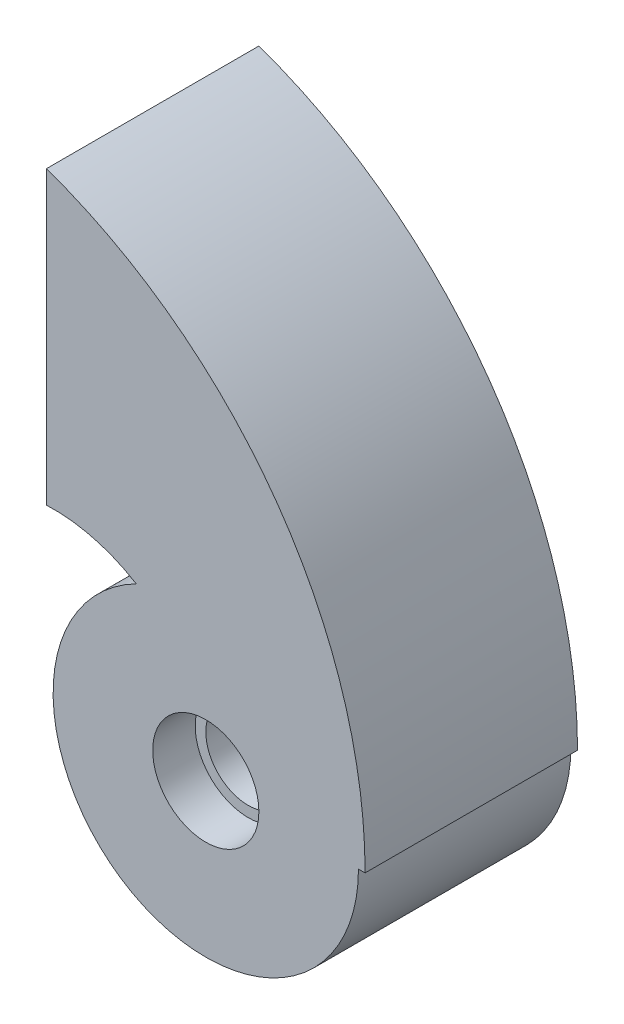
ISO-10303-21;
HEADER;
FILE_DESCRIPTION(('STEP AP214'),'2;1');
FILE_NAME('part.step','',(''),(''),'','','');
FILE_SCHEMA(('AUTOMOTIVE_DESIGN { 1 0 10303 214 1 1 1 1 }'));
ENDSEC;
DATA;
#1=APPLICATION_CONTEXT('core data for automotive mechanical design processes');
#2=APPLICATION_PROTOCOL_DEFINITION('international standard','automotive_design',2000,#1);
#3=PRODUCT_CONTEXT('',#1,'mechanical');
#4=PRODUCT('Part','Part','',(#3));
#5=PRODUCT_RELATED_PRODUCT_CATEGORY('part','',(#4));
#6=PRODUCT_DEFINITION_FORMATION('','',#4);
#7=PRODUCT_DEFINITION_CONTEXT('part definition',#1,'design');
#8=PRODUCT_DEFINITION('design','',#6,#7);
#9=PRODUCT_DEFINITION_SHAPE('','',#8);
#10=(LENGTH_UNIT() NAMED_UNIT(*) SI_UNIT(.MILLI.,.METRE.));
#11=(NAMED_UNIT(*) PLANE_ANGLE_UNIT() SI_UNIT($,.RADIAN.));
#12=(NAMED_UNIT(*) SI_UNIT($,.STERADIAN.) SOLID_ANGLE_UNIT());
#13=UNCERTAINTY_MEASURE_WITH_UNIT(LENGTH_MEASURE(1.E-05),#10,'distance_accuracy_value','');
#14=(GEOMETRIC_REPRESENTATION_CONTEXT(3) GLOBAL_UNCERTAINTY_ASSIGNED_CONTEXT((#13)) GLOBAL_UNIT_ASSIGNED_CONTEXT((#10,
#11,#12)) REPRESENTATION_CONTEXT('',''));
#15=CARTESIAN_POINT('',(0.,0.,0.));
#16=DIRECTION('',(0.,0.,1.));
#17=DIRECTION('',(1.,0.,0.));
#18=AXIS2_PLACEMENT_3D('',#15,#16,#17);
#19=CARTESIAN_POINT('',(0.,0.,-10.));
#20=DIRECTION('',(0.,0.,1.));
#21=DIRECTION('',(1.,0.,0.));
#22=AXIS2_PLACEMENT_3D('',#19,#20,#21);
#23=CYLINDRICAL_SURFACE('',#22,4.);
#24=CARTESIAN_POINT('',(0.,0.,-6.));
#25=DIRECTION('',(0.,0.,-1.));
#26=DIRECTION('',(-1.,0.,0.));
#27=AXIS2_PLACEMENT_3D('',#24,#25,#26);
#28=CIRCLE('',#27,4.);
#29=CARTESIAN_POINT('',(-4.,0.,-6.));
#30=VERTEX_POINT('',#29);
#31=EDGE_CURVE('E109',#30,#30,#28,.F.);
#32=ORIENTED_EDGE('',*,*,#31,.F.);
#33=EDGE_LOOP('',(#32));
#34=FACE_BOUND('',#33,.T.);
#35=CARTESIAN_POINT('',(0.,0.,6.));
#36=DIRECTION('',(0.,0.,1.));
#37=DIRECTION('',(1.,0.,0.));
#38=AXIS2_PLACEMENT_3D('',#35,#36,#37);
#39=CIRCLE('',#38,4.);
#40=CARTESIAN_POINT('',(4.,0.,6.));
#41=VERTEX_POINT('',#40);
#42=EDGE_CURVE('E43',#41,#41,#39,.F.);
#43=ORIENTED_EDGE('',*,*,#42,.F.);
#44=EDGE_LOOP('',(#43));
#45=FACE_BOUND('',#44,.T.);
#46=ADVANCED_FACE('F39',(#34,#45),#23,.F.);
#47=CARTESIAN_POINT('',(0.,0.,-10.));
#48=DIRECTION('',(0.,0.,1.));
#49=DIRECTION('',(1.,0.,0.));
#50=AXIS2_PLACEMENT_3D('',#47,#48,#49);
#51=CYLINDRICAL_SURFACE('',#50,14.375);
#52=DIRECTION('',(0.,0.,1.));
#53=VECTOR('',#52,1.);
#54=CARTESIAN_POINT('',(14.375,0.,-10.));
#55=LINE('',#54,#53);
#56=CARTESIAN_POINT('',(14.375,0.,10.));
#57=VERTEX_POINT('',#56);
#58=CARTESIAN_POINT('',(14.375,0.,-10.));
#59=VERTEX_POINT('',#58);
#60=EDGE_CURVE('E126',#57,#59,#55,.F.);
#61=ORIENTED_EDGE('',*,*,#60,.F.);
#62=CARTESIAN_POINT('',(0.,0.,10.));
#63=DIRECTION('',(0.,0.,1.));
#64=DIRECTION('',(1.,0.,0.));
#65=AXIS2_PLACEMENT_3D('',#62,#63,#64);
#66=CIRCLE('',#65,14.375);
#67=CARTESIAN_POINT('',(-6.54891304347826,12.7965762197926,10.));
#68=VERTEX_POINT('',#67);
#69=EDGE_CURVE('E48',#68,#57,#66,.T.);
#70=ORIENTED_EDGE('',*,*,#69,.F.);
#71=DIRECTION('',(0.,0.,1.));
#72=VECTOR('',#71,1.);
#73=CARTESIAN_POINT('',(-6.54891304347826,12.7965762197926,0.));
#74=LINE('',#73,#72);
#75=CARTESIAN_POINT('',(-6.54891304347826,12.7965762197926,-10.));
#76=VERTEX_POINT('',#75);
#77=EDGE_CURVE('E124',#76,#68,#74,.T.);
#78=ORIENTED_EDGE('',*,*,#77,.F.);
#79=CARTESIAN_POINT('',(0.,0.,-10.));
#80=DIRECTION('',(0.,0.,1.));
#81=DIRECTION('',(1.,0.,0.));
#82=AXIS2_PLACEMENT_3D('',#79,#80,#81);
#83=CIRCLE('',#82,14.375);
#84=EDGE_CURVE('E11',#76,#59,#83,.T.);
#85=ORIENTED_EDGE('',*,*,#84,.T.);
#86=EDGE_LOOP('',(#61,#70,#78,#85));
#87=FACE_BOUND('',#86,.T.);
#88=ADVANCED_FACE('F41',(#87),#51,.T.);
#89=CARTESIAN_POINT('',(0.,0.,-10.));
#90=DIRECTION('',(0.,0.,1.));
#91=DIRECTION('',(1.,0.,0.));
#92=AXIS2_PLACEMENT_3D('',#89,#90,#91);
#93=PLANE('',#92);
#94=CARTESIAN_POINT('',(0.,0.,-10.));
#95=DIRECTION('',(0.,0.,-1.));
#96=DIRECTION('',(-1.,0.,0.));
#97=AXIS2_PLACEMENT_3D('',#94,#95,#96);
#98=CIRCLE('',#97,5.);
#99=CARTESIAN_POINT('',(-5.,0.,-10.));
#100=VERTEX_POINT('',#99);
#101=EDGE_CURVE('E136',#100,#100,#98,.T.);
#102=ORIENTED_EDGE('',*,*,#101,.F.);
#103=EDGE_LOOP('',(#102));
#104=FACE_BOUND('',#103,.T.);
#105=ORIENTED_EDGE('',*,*,#84,.F.);
#106=CARTESIAN_POINT('',(-14.375,0.,-10.));
#107=DIRECTION('',(0.,0.,1.));
#108=DIRECTION('',(1.,0.,0.));
#109=AXIS2_PLACEMENT_3D('',#106,#107,#108);
#110=CIRCLE('',#109,15.);
#111=CARTESIAN_POINT('',(-15.,14.9869735103522,-10.));
#112=VERTEX_POINT('',#111);
#113=EDGE_CURVE('E120',#76,#112,#110,.T.);
#114=ORIENTED_EDGE('',*,*,#113,.T.);
#115=DIRECTION('',(0.,1.,0.));
#116=VECTOR('',#115,1.);
#117=CARTESIAN_POINT('',(-15.,42.4264068711928,-10.));
#118=LINE('',#117,#116);
#119=CARTESIAN_POINT('',(-15.,42.4264068711928,-10.));
#120=VERTEX_POINT('',#119);
#121=EDGE_CURVE('E122',#112,#120,#118,.T.);
#122=ORIENTED_EDGE('',*,*,#121,.T.);
#123=CARTESIAN_POINT('',(-30.,0.,-10.));
#124=DIRECTION('',(0.,0.,1.));
#125=DIRECTION('',(1.,0.,0.));
#126=AXIS2_PLACEMENT_3D('',#123,#124,#125);
#127=CIRCLE('',#126,45.);
#128=CARTESIAN_POINT('',(15.,0.,-10.));
#129=VERTEX_POINT('',#128);
#130=EDGE_CURVE('E91',#120,#129,#127,.F.);
#131=ORIENTED_EDGE('',*,*,#130,.T.);
#132=DIRECTION('',(-1.,0.,0.));
#133=VECTOR('',#132,1.);
#134=CARTESIAN_POINT('',(0.624999999999999,0.,-10.));
#135=LINE('',#134,#133);
#136=EDGE_CURVE('E132',#129,#59,#135,.T.);
#137=ORIENTED_EDGE('',*,*,#136,.T.);
#138=EDGE_LOOP('',(#105,#114,#122,#131,#137));
#139=FACE_BOUND('',#138,.T.);
#140=ADVANCED_FACE('F159',(#104,#139),#93,.F.);
#141=CARTESIAN_POINT('',(0.,0.,10.));
#142=DIRECTION('',(0.,0.,1.));
#143=DIRECTION('',(1.,0.,0.));
#144=AXIS2_PLACEMENT_3D('',#141,#142,#143);
#145=PLANE('',#144);
#146=CARTESIAN_POINT('',(0.,0.,10.));
#147=DIRECTION('',(0.,0.,1.));
#148=DIRECTION('',(1.,0.,0.));
#149=AXIS2_PLACEMENT_3D('',#146,#147,#148);
#150=CIRCLE('',#149,5.);
#151=CARTESIAN_POINT('',(5.,0.,10.));
#152=VERTEX_POINT('',#151);
#153=EDGE_CURVE('E141',#152,#152,#150,.T.);
#154=ORIENTED_EDGE('',*,*,#153,.F.);
#155=EDGE_LOOP('',(#154));
#156=FACE_BOUND('',#155,.T.);
#157=ORIENTED_EDGE('',*,*,#69,.T.);
#158=DIRECTION('',(1.,0.,0.));
#159=VECTOR('',#158,1.);
#160=CARTESIAN_POINT('',(0.624999999999999,0.,10.));
#161=LINE('',#160,#159);
#162=CARTESIAN_POINT('',(15.,0.,10.));
#163=VERTEX_POINT('',#162);
#164=EDGE_CURVE('E95',#57,#163,#161,.T.);
#165=ORIENTED_EDGE('',*,*,#164,.T.);
#166=CARTESIAN_POINT('',(-30.,0.,10.));
#167=DIRECTION('',(0.,0.,1.));
#168=DIRECTION('',(1.,0.,0.));
#169=AXIS2_PLACEMENT_3D('',#166,#167,#168);
#170=CIRCLE('',#169,45.);
#171=CARTESIAN_POINT('',(-15.,42.4264068711928,10.));
#172=VERTEX_POINT('',#171);
#173=EDGE_CURVE('E90',#163,#172,#170,.T.);
#174=ORIENTED_EDGE('',*,*,#173,.T.);
#175=DIRECTION('',(0.,-1.,0.));
#176=VECTOR('',#175,1.);
#177=CARTESIAN_POINT('',(-15.,42.4264068711928,10.));
#178=LINE('',#177,#176);
#179=CARTESIAN_POINT('',(-15.,14.9869735103522,10.));
#180=VERTEX_POINT('',#179);
#181=EDGE_CURVE('E98',#172,#180,#178,.T.);
#182=ORIENTED_EDGE('',*,*,#181,.T.);
#183=CARTESIAN_POINT('',(-14.375,0.,10.));
#184=DIRECTION('',(0.,0.,-1.));
#185=DIRECTION('',(-1.,0.,0.));
#186=AXIS2_PLACEMENT_3D('',#183,#184,#185);
#187=CIRCLE('',#186,15.);
#188=EDGE_CURVE('E104',#180,#68,#187,.T.);
#189=ORIENTED_EDGE('',*,*,#188,.T.);
#190=EDGE_LOOP('',(#157,#165,#174,#182,#189));
#191=FACE_BOUND('',#190,.T.);
#192=ADVANCED_FACE('F106',(#156,#191),#145,.T.);
#193=CARTESIAN_POINT('',(-30.,0.,-61.9615242270663));
#194=DIRECTION('',(0.,0.,1.));
#195=DIRECTION('',(1.,0.,0.));
#196=AXIS2_PLACEMENT_3D('',#193,#194,#195);
#197=CYLINDRICAL_SURFACE('',#196,45.);
#198=ORIENTED_EDGE('',*,*,#130,.F.);
#199=DIRECTION('',(0.,0.,1.));
#200=VECTOR('',#199,1.);
#201=CARTESIAN_POINT('',(-15.,42.4264068711928,-61.9615242270663));
#202=LINE('',#201,#200);
#203=EDGE_CURVE('E85',#120,#172,#202,.T.);
#204=ORIENTED_EDGE('',*,*,#203,.T.);
#205=ORIENTED_EDGE('',*,*,#173,.F.);
#206=DIRECTION('',(0.,0.,1.));
#207=VECTOR('',#206,1.);
#208=CARTESIAN_POINT('',(15.,0.,-61.9615242270663));
#209=LINE('',#208,#207);
#210=EDGE_CURVE('E118',#129,#163,#209,.T.);
#211=ORIENTED_EDGE('',*,*,#210,.F.);
#212=EDGE_LOOP('',(#198,#204,#205,#211));
#213=FACE_BOUND('',#212,.T.);
#214=ADVANCED_FACE('F87',(#213),#197,.T.);
#215=CARTESIAN_POINT('',(0.624999999999999,0.,-61.9615242270663));
#216=DIRECTION('',(0.,-1.,0.));
#217=DIRECTION('',(0.,0.,-1.));
#218=AXIS2_PLACEMENT_3D('',#215,#216,#217);
#219=PLANE('',#218);
#220=ORIENTED_EDGE('',*,*,#164,.F.);
#221=ORIENTED_EDGE('',*,*,#60,.T.);
#222=ORIENTED_EDGE('',*,*,#136,.F.);
#223=ORIENTED_EDGE('',*,*,#210,.T.);
#224=EDGE_LOOP('',(#220,#221,#222,#223));
#225=FACE_BOUND('',#224,.T.);
#226=ADVANCED_FACE('F129',(#225),#219,.T.);
#227=CARTESIAN_POINT('',(-14.375,0.,-61.9615242270663));
#228=DIRECTION('',(0.,0.,1.));
#229=DIRECTION('',(1.,0.,0.));
#230=AXIS2_PLACEMENT_3D('',#227,#228,#229);
#231=CYLINDRICAL_SURFACE('',#230,15.);
#232=ORIENTED_EDGE('',*,*,#113,.F.);
#233=ORIENTED_EDGE('',*,*,#77,.T.);
#234=ORIENTED_EDGE('',*,*,#188,.F.);
#235=DIRECTION('',(0.,0.,1.));
#236=VECTOR('',#235,1.);
#237=CARTESIAN_POINT('',(-15.,14.9869735103522,-61.9615242270663));
#238=LINE('',#237,#236);
#239=EDGE_CURVE('E94',#112,#180,#238,.T.);
#240=ORIENTED_EDGE('',*,*,#239,.F.);
#241=EDGE_LOOP('',(#232,#233,#234,#240));
#242=FACE_BOUND('',#241,.T.);
#243=ADVANCED_FACE('F167',(#242),#231,.F.);
#244=CARTESIAN_POINT('',(-15.,42.4264068711928,-61.9615242270663));
#245=DIRECTION('',(-1.,0.,0.));
#246=DIRECTION('',(0.,0.,1.));
#247=AXIS2_PLACEMENT_3D('',#244,#245,#246);
#248=PLANE('',#247);
#249=ORIENTED_EDGE('',*,*,#121,.F.);
#250=ORIENTED_EDGE('',*,*,#239,.T.);
#251=ORIENTED_EDGE('',*,*,#181,.F.);
#252=ORIENTED_EDGE('',*,*,#203,.F.);
#253=EDGE_LOOP('',(#249,#250,#251,#252));
#254=FACE_BOUND('',#253,.T.);
#255=ADVANCED_FACE('F99',(#254),#248,.T.);
#256=CARTESIAN_POINT('',(0.,0.,-6.));
#257=DIRECTION('',(0.,0.,-1.));
#258=DIRECTION('',(-1.,0.,0.));
#259=AXIS2_PLACEMENT_3D('',#256,#257,#258);
#260=PLANE('',#259);
#261=CARTESIAN_POINT('',(0.,0.,-6.));
#262=DIRECTION('',(0.,0.,-1.));
#263=DIRECTION('',(-1.,0.,0.));
#264=AXIS2_PLACEMENT_3D('',#261,#262,#263);
#265=CIRCLE('',#264,5.);
#266=CARTESIAN_POINT('',(-5.,0.,-6.));
#267=VERTEX_POINT('',#266);
#268=EDGE_CURVE('E112',#267,#267,#265,.T.);
#269=ORIENTED_EDGE('',*,*,#268,.T.);
#270=EDGE_LOOP('',(#269));
#271=FACE_BOUND('',#270,.T.);
#272=ORIENTED_EDGE('',*,*,#31,.T.);
#273=EDGE_LOOP('',(#272));
#274=FACE_BOUND('',#273,.T.);
#275=ADVANCED_FACE('F173',(#271,#274),#260,.T.);
#276=CARTESIAN_POINT('',(0.,0.,-6.));
#277=DIRECTION('',(0.,0.,-1.));
#278=DIRECTION('',(-1.,0.,0.));
#279=AXIS2_PLACEMENT_3D('',#276,#277,#278);
#280=CYLINDRICAL_SURFACE('',#279,5.);
#281=ORIENTED_EDGE('',*,*,#268,.F.);
#282=EDGE_LOOP('',(#281));
#283=FACE_BOUND('',#282,.T.);
#284=ORIENTED_EDGE('',*,*,#101,.T.);
#285=EDGE_LOOP('',(#284));
#286=FACE_BOUND('',#285,.T.);
#287=ADVANCED_FACE('F163',(#283,#286),#280,.F.);
#288=CARTESIAN_POINT('',(0.,0.,6.));
#289=DIRECTION('',(0.,0.,1.));
#290=DIRECTION('',(1.,0.,0.));
#291=AXIS2_PLACEMENT_3D('',#288,#289,#290);
#292=PLANE('',#291);
#293=CARTESIAN_POINT('',(0.,0.,6.));
#294=DIRECTION('',(0.,0.,1.));
#295=DIRECTION('',(1.,0.,0.));
#296=AXIS2_PLACEMENT_3D('',#293,#294,#295);
#297=CIRCLE('',#296,5.);
#298=CARTESIAN_POINT('',(5.,0.,6.));
#299=VERTEX_POINT('',#298);
#300=EDGE_CURVE('E144',#299,#299,#297,.T.);
#301=ORIENTED_EDGE('',*,*,#300,.T.);
#302=EDGE_LOOP('',(#301));
#303=FACE_BOUND('',#302,.T.);
#304=ORIENTED_EDGE('',*,*,#42,.T.);
#305=EDGE_LOOP('',(#304));
#306=FACE_BOUND('',#305,.T.);
#307=ADVANCED_FACE('F151',(#303,#306),#292,.T.);
#308=CARTESIAN_POINT('',(0.,0.,6.));
#309=DIRECTION('',(0.,0.,1.));
#310=DIRECTION('',(1.,0.,0.));
#311=AXIS2_PLACEMENT_3D('',#308,#309,#310);
#312=CYLINDRICAL_SURFACE('',#311,5.);
#313=ORIENTED_EDGE('',*,*,#300,.F.);
#314=EDGE_LOOP('',(#313));
#315=FACE_BOUND('',#314,.T.);
#316=ORIENTED_EDGE('',*,*,#153,.T.);
#317=EDGE_LOOP('',(#316));
#318=FACE_BOUND('',#317,.T.);
#319=ADVANCED_FACE('F191',(#315,#318),#312,.F.);
#320=CLOSED_SHELL('',(#46,#88,#140,#192,#214,#226,#243,#255,#275,#287,#307,#319));
#321=MANIFOLD_SOLID_BREP('B2',#320);
#322=ADVANCED_BREP_SHAPE_REPRESENTATION('',(#18,#321),#14);
#323=SHAPE_DEFINITION_REPRESENTATION(#9,#322);
ENDSEC;
END-ISO-10303-21;
